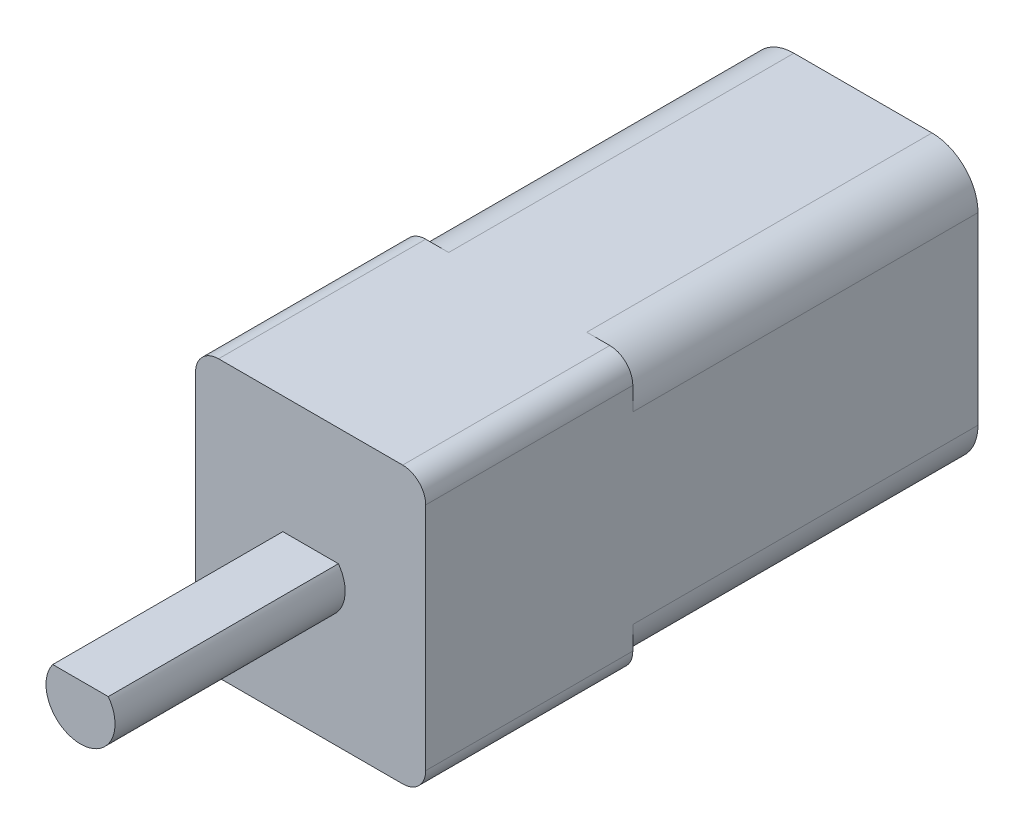
ISO-10303-21;
HEADER;
FILE_DESCRIPTION(('STEP AP214'),'2;1');
FILE_NAME('part.step','',(''),(''),'','','');
FILE_SCHEMA(('AUTOMOTIVE_DESIGN { 1 0 10303 214 1 1 1 1 }'));
ENDSEC;
DATA;
#1=APPLICATION_CONTEXT('core data for automotive mechanical design processes');
#2=APPLICATION_PROTOCOL_DEFINITION('international standard','automotive_design',2000,#1);
#3=PRODUCT_CONTEXT('',#1,'mechanical');
#4=PRODUCT('Part','Part','',(#3));
#5=PRODUCT_RELATED_PRODUCT_CATEGORY('part','',(#4));
#6=PRODUCT_DEFINITION_FORMATION('','',#4);
#7=PRODUCT_DEFINITION_CONTEXT('part definition',#1,'design');
#8=PRODUCT_DEFINITION('design','',#6,#7);
#9=PRODUCT_DEFINITION_SHAPE('','',#8);
#10=(LENGTH_UNIT() NAMED_UNIT(*) SI_UNIT(.MILLI.,.METRE.));
#11=(NAMED_UNIT(*) PLANE_ANGLE_UNIT() SI_UNIT($,.RADIAN.));
#12=(NAMED_UNIT(*) SI_UNIT($,.STERADIAN.) SOLID_ANGLE_UNIT());
#13=UNCERTAINTY_MEASURE_WITH_UNIT(LENGTH_MEASURE(1.E-05),#10,'distance_accuracy_value','');
#14=(GEOMETRIC_REPRESENTATION_CONTEXT(3) GLOBAL_UNCERTAINTY_ASSIGNED_CONTEXT((#13)) GLOBAL_UNIT_ASSIGNED_CONTEXT((#10,
#11,#12)) REPRESENTATION_CONTEXT('',''));
#15=CARTESIAN_POINT('',(0.,0.,0.));
#16=DIRECTION('',(0.,0.,1.));
#17=DIRECTION('',(1.,0.,0.));
#18=AXIS2_PLACEMENT_3D('',#15,#16,#17);
#19=CARTESIAN_POINT('',(1.,1.,24.));
#20=DIRECTION('',(0.,0.,-1.));
#21=DIRECTION('',(-1.,0.,0.));
#22=AXIS2_PLACEMENT_3D('',#19,#20,#21);
#23=PLANE('',#22);
#24=CARTESIAN_POINT('',(1.,1.,24.));
#25=DIRECTION('',(0.,0.,1.));
#26=DIRECTION('',(-1.,0.,0.));
#27=AXIS2_PLACEMENT_3D('',#24,#25,#26);
#28=CIRCLE('',#27,1.);
#29=CARTESIAN_POINT('',(0.,1.00000000000001,24.));
#30=VERTEX_POINT('',#29);
#31=CARTESIAN_POINT('',(1.00000000000001,0.,24.));
#32=VERTEX_POINT('',#31);
#33=EDGE_CURVE('E168',#30,#32,#28,.T.);
#34=ORIENTED_EDGE('',*,*,#33,.T.);
#35=DIRECTION('',(1.,0.,0.));
#36=VECTOR('',#35,1.);
#37=CARTESIAN_POINT('',(1.00000000000001,0.,24.));
#38=LINE('',#37,#36);
#39=CARTESIAN_POINT('',(8.99999999999999,0.,24.));
#40=VERTEX_POINT('',#39);
#41=EDGE_CURVE('E339',#32,#40,#38,.T.);
#42=ORIENTED_EDGE('',*,*,#41,.T.);
#43=CARTESIAN_POINT('',(9.,1.,24.));
#44=DIRECTION('',(0.,0.,1.));
#45=DIRECTION('',(-1.,0.,0.));
#46=AXIS2_PLACEMENT_3D('',#43,#44,#45);
#47=CIRCLE('',#46,1.);
#48=CARTESIAN_POINT('',(10.,1.00000000000001,24.));
#49=VERTEX_POINT('',#48);
#50=EDGE_CURVE('E312',#40,#49,#47,.T.);
#51=ORIENTED_EDGE('',*,*,#50,.T.);
#52=DIRECTION('',(0.,1.,0.));
#53=VECTOR('',#52,1.);
#54=CARTESIAN_POINT('',(10.,1.00000000000001,24.));
#55=LINE('',#54,#53);
#56=CARTESIAN_POINT('',(10.,11.,24.));
#57=VERTEX_POINT('',#56);
#58=EDGE_CURVE('E306',#49,#57,#55,.T.);
#59=ORIENTED_EDGE('',*,*,#58,.T.);
#60=CARTESIAN_POINT('',(9.,11.,24.));
#61=DIRECTION('',(0.,0.,1.));
#62=DIRECTION('',(1.,0.,0.));
#63=AXIS2_PLACEMENT_3D('',#60,#61,#62);
#64=CIRCLE('',#63,0.999999999999999);
#65=CARTESIAN_POINT('',(8.99999999999999,12.,24.));
#66=VERTEX_POINT('',#65);
#67=EDGE_CURVE('E297',#57,#66,#64,.T.);
#68=ORIENTED_EDGE('',*,*,#67,.T.);
#69=DIRECTION('',(-1.,0.,0.));
#70=VECTOR('',#69,1.);
#71=CARTESIAN_POINT('',(1.00000000000001,12.,24.));
#72=LINE('',#71,#70);
#73=CARTESIAN_POINT('',(1.00000000000001,12.,24.));
#74=VERTEX_POINT('',#73);
#75=EDGE_CURVE('E305',#66,#74,#72,.T.);
#76=ORIENTED_EDGE('',*,*,#75,.T.);
#77=CARTESIAN_POINT('',(1.,11.,24.));
#78=DIRECTION('',(0.,0.,1.));
#79=DIRECTION('',(-1.,0.,0.));
#80=AXIS2_PLACEMENT_3D('',#77,#78,#79);
#81=CIRCLE('',#80,1.);
#82=CARTESIAN_POINT('',(0.,11.,24.));
#83=VERTEX_POINT('',#82);
#84=EDGE_CURVE('E310',#74,#83,#81,.T.);
#85=ORIENTED_EDGE('',*,*,#84,.T.);
#86=DIRECTION('',(0.,-1.,0.));
#87=VECTOR('',#86,1.);
#88=CARTESIAN_POINT('',(0.,1.00000000000001,24.));
#89=LINE('',#88,#87);
#90=EDGE_CURVE('E174',#83,#30,#89,.T.);
#91=ORIENTED_EDGE('',*,*,#90,.T.);
#92=EDGE_LOOP('',(#34,#42,#51,#59,#68,#76,#85,#91));
#93=FACE_BOUND('',#92,.T.);
#94=CARTESIAN_POINT('',(5.,6.,24.));
#95=DIRECTION('',(0.,0.,1.));
#96=DIRECTION('',(1.,0.,0.));
#97=AXIS2_PLACEMENT_3D('',#94,#95,#96);
#98=CIRCLE('',#97,1.5);
#99=CARTESIAN_POINT('',(3.79333531330161,6.89104451845857,24.));
#100=VERTEX_POINT('',#99);
#101=CARTESIAN_POINT('',(6.20666468669839,6.89104451845857,24.));
#102=VERTEX_POINT('',#101);
#103=EDGE_CURVE('E56',#100,#102,#98,.T.);
#104=ORIENTED_EDGE('',*,*,#103,.F.);
#105=DIRECTION('',(1.,0.,0.));
#106=VECTOR('',#105,1.);
#107=CARTESIAN_POINT('',(0.,6.89104451845857,24.));
#108=LINE('',#107,#106);
#109=EDGE_CURVE('E387',#100,#102,#108,.T.);
#110=ORIENTED_EDGE('',*,*,#109,.T.);
#111=EDGE_LOOP('',(#104,#110));
#112=FACE_BOUND('',#111,.T.);
#113=ADVANCED_FACE('F41',(#93,#112),#23,.F.);
#114=CARTESIAN_POINT('',(2.,2.,15.));
#115=DIRECTION('',(0.,0.,-1.));
#116=DIRECTION('',(-1.,0.,0.));
#117=AXIS2_PLACEMENT_3D('',#114,#115,#116);
#118=CYLINDRICAL_SURFACE('',#117,2.);
#119=CARTESIAN_POINT('',(2.,2.,0.));
#120=DIRECTION('',(0.,0.,1.));
#121=DIRECTION('',(-1.,0.,0.));
#122=AXIS2_PLACEMENT_3D('',#119,#120,#121);
#123=CIRCLE('',#122,2.);
#124=CARTESIAN_POINT('',(0.,2.00000000000001,0.));
#125=VERTEX_POINT('',#124);
#126=CARTESIAN_POINT('',(2.00000000000001,0.,0.));
#127=VERTEX_POINT('',#126);
#128=EDGE_CURVE('E200',#125,#127,#123,.T.);
#129=ORIENTED_EDGE('',*,*,#128,.T.);
#130=DIRECTION('',(0.,0.,-1.));
#131=VECTOR('',#130,1.);
#132=CARTESIAN_POINT('',(2.00000000000001,0.,15.));
#133=LINE('',#132,#131);
#134=CARTESIAN_POINT('',(2.00000000000001,0.,15.));
#135=VERTEX_POINT('',#134);
#136=EDGE_CURVE('E11',#135,#127,#133,.T.);
#137=ORIENTED_EDGE('',*,*,#136,.F.);
#138=CARTESIAN_POINT('',(2.,2.,15.));
#139=DIRECTION('',(0.,0.,1.));
#140=DIRECTION('',(-1.,0.,0.));
#141=AXIS2_PLACEMENT_3D('',#138,#139,#140);
#142=CIRCLE('',#141,2.);
#143=CARTESIAN_POINT('',(0.,2.00000000000001,15.));
#144=VERTEX_POINT('',#143);
#145=EDGE_CURVE('E201',#144,#135,#142,.T.);
#146=ORIENTED_EDGE('',*,*,#145,.F.);
#147=DIRECTION('',(0.,0.,-1.));
#148=VECTOR('',#147,1.);
#149=CARTESIAN_POINT('',(0.,2.00000000000001,15.));
#150=LINE('',#149,#148);
#151=EDGE_CURVE('E65',#144,#125,#150,.T.);
#152=ORIENTED_EDGE('',*,*,#151,.T.);
#153=EDGE_LOOP('',(#129,#137,#146,#152));
#154=FACE_BOUND('',#153,.T.);
#155=ADVANCED_FACE('F43',(#154),#118,.T.);
#156=CARTESIAN_POINT('',(2.00000000000001,0.,15.));
#157=DIRECTION('',(0.,1.,0.));
#158=DIRECTION('',(0.,0.,1.));
#159=AXIS2_PLACEMENT_3D('',#156,#157,#158);
#160=PLANE('',#159);
#161=DIRECTION('',(1.,0.,0.));
#162=VECTOR('',#161,1.);
#163=CARTESIAN_POINT('',(2.00000000000001,0.,0.));
#164=LINE('',#163,#162);
#165=CARTESIAN_POINT('',(7.99999999999999,0.,0.));
#166=VERTEX_POINT('',#165);
#167=EDGE_CURVE('E212',#127,#166,#164,.T.);
#168=ORIENTED_EDGE('',*,*,#167,.T.);
#169=DIRECTION('',(0.,0.,-1.));
#170=VECTOR('',#169,1.);
#171=CARTESIAN_POINT('',(7.99999999999999,0.,15.));
#172=LINE('',#171,#170);
#173=CARTESIAN_POINT('',(7.99999999999999,0.,15.));
#174=VERTEX_POINT('',#173);
#175=EDGE_CURVE('E50',#174,#166,#172,.T.);
#176=ORIENTED_EDGE('',*,*,#175,.F.);
#177=DIRECTION('',(1.,0.,0.));
#178=VECTOR('',#177,1.);
#179=CARTESIAN_POINT('',(1.00000000000001,0.,15.));
#180=LINE('',#179,#178);
#181=CARTESIAN_POINT('',(8.99999999999999,0.,15.));
#182=VERTEX_POINT('',#181);
#183=EDGE_CURVE('E266',#174,#182,#180,.T.);
#184=ORIENTED_EDGE('',*,*,#183,.T.);
#185=DIRECTION('',(0.,0.,-1.));
#186=VECTOR('',#185,1.);
#187=CARTESIAN_POINT('',(8.99999999999999,0.,24.));
#188=LINE('',#187,#186);
#189=EDGE_CURVE('E192',#40,#182,#188,.T.);
#190=ORIENTED_EDGE('',*,*,#189,.F.);
#191=ORIENTED_EDGE('',*,*,#41,.F.);
#192=DIRECTION('',(0.,0.,-1.));
#193=VECTOR('',#192,1.);
#194=CARTESIAN_POINT('',(1.00000000000001,0.,24.));
#195=LINE('',#194,#193);
#196=CARTESIAN_POINT('',(1.00000000000001,0.,15.));
#197=VERTEX_POINT('',#196);
#198=EDGE_CURVE('E196',#32,#197,#195,.T.);
#199=ORIENTED_EDGE('',*,*,#198,.T.);
#200=EDGE_CURVE('E272',#197,#135,#180,.T.);
#201=ORIENTED_EDGE('',*,*,#200,.T.);
#202=ORIENTED_EDGE('',*,*,#136,.T.);
#203=EDGE_LOOP('',(#168,#176,#184,#190,#191,#199,#201,#202));
#204=FACE_BOUND('',#203,.T.);
#205=ADVANCED_FACE('F418',(#204),#160,.F.);
#206=CARTESIAN_POINT('',(8.,2.,15.));
#207=DIRECTION('',(0.,0.,-1.));
#208=DIRECTION('',(-1.,0.,0.));
#209=AXIS2_PLACEMENT_3D('',#206,#207,#208);
#210=CYLINDRICAL_SURFACE('',#209,2.);
#211=CARTESIAN_POINT('',(8.,2.,0.));
#212=DIRECTION('',(0.,0.,1.));
#213=DIRECTION('',(1.,0.,0.));
#214=AXIS2_PLACEMENT_3D('',#211,#212,#213);
#215=CIRCLE('',#214,2.);
#216=CARTESIAN_POINT('',(10.,2.,0.));
#217=VERTEX_POINT('',#216);
#218=EDGE_CURVE('E215',#166,#217,#215,.T.);
#219=ORIENTED_EDGE('',*,*,#218,.T.);
#220=DIRECTION('',(0.,0.,-1.));
#221=VECTOR('',#220,1.);
#222=CARTESIAN_POINT('',(10.,2.,15.));
#223=LINE('',#222,#221);
#224=CARTESIAN_POINT('',(10.,2.,15.));
#225=VERTEX_POINT('',#224);
#226=EDGE_CURVE('E241',#225,#217,#223,.T.);
#227=ORIENTED_EDGE('',*,*,#226,.F.);
#228=CARTESIAN_POINT('',(8.,2.,15.));
#229=DIRECTION('',(0.,0.,1.));
#230=DIRECTION('',(1.,0.,0.));
#231=AXIS2_PLACEMENT_3D('',#228,#229,#230);
#232=CIRCLE('',#231,2.);
#233=EDGE_CURVE('E143',#174,#225,#232,.T.);
#234=ORIENTED_EDGE('',*,*,#233,.F.);
#235=ORIENTED_EDGE('',*,*,#175,.T.);
#236=EDGE_LOOP('',(#219,#227,#234,#235));
#237=FACE_BOUND('',#236,.T.);
#238=ADVANCED_FACE('F249',(#237),#210,.T.);
#239=CARTESIAN_POINT('',(10.,2.00000000000001,15.));
#240=DIRECTION('',(-1.,0.,0.));
#241=DIRECTION('',(0.,0.,1.));
#242=AXIS2_PLACEMENT_3D('',#239,#240,#241);
#243=PLANE('',#242);
#244=DIRECTION('',(0.,1.,0.));
#245=VECTOR('',#244,1.);
#246=CARTESIAN_POINT('',(10.,2.00000000000001,0.));
#247=LINE('',#246,#245);
#248=CARTESIAN_POINT('',(10.,9.99999999999999,0.));
#249=VERTEX_POINT('',#248);
#250=EDGE_CURVE('E218',#217,#249,#247,.T.);
#251=ORIENTED_EDGE('',*,*,#250,.T.);
#252=DIRECTION('',(0.,0.,-1.));
#253=VECTOR('',#252,1.);
#254=CARTESIAN_POINT('',(10.,9.99999999999999,15.));
#255=LINE('',#254,#253);
#256=CARTESIAN_POINT('',(10.,9.99999999999999,15.));
#257=VERTEX_POINT('',#256);
#258=EDGE_CURVE('E130',#257,#249,#255,.T.);
#259=ORIENTED_EDGE('',*,*,#258,.F.);
#260=DIRECTION('',(0.,1.,0.));
#261=VECTOR('',#260,1.);
#262=CARTESIAN_POINT('',(10.,1.00000000000001,15.));
#263=LINE('',#262,#261);
#264=CARTESIAN_POINT('',(10.,11.,15.));
#265=VERTEX_POINT('',#264);
#266=EDGE_CURVE('E140',#257,#265,#263,.T.);
#267=ORIENTED_EDGE('',*,*,#266,.T.);
#268=DIRECTION('',(0.,0.,-1.));
#269=VECTOR('',#268,1.);
#270=CARTESIAN_POINT('',(10.,11.,24.));
#271=LINE('',#270,#269);
#272=EDGE_CURVE('E184',#57,#265,#271,.T.);
#273=ORIENTED_EDGE('',*,*,#272,.F.);
#274=ORIENTED_EDGE('',*,*,#58,.F.);
#275=DIRECTION('',(0.,0.,-1.));
#276=VECTOR('',#275,1.);
#277=CARTESIAN_POINT('',(10.,1.00000000000001,24.));
#278=LINE('',#277,#276);
#279=CARTESIAN_POINT('',(10.,1.00000000000001,15.));
#280=VERTEX_POINT('',#279);
#281=EDGE_CURVE('E188',#49,#280,#278,.T.);
#282=ORIENTED_EDGE('',*,*,#281,.T.);
#283=EDGE_CURVE('E261',#280,#225,#263,.T.);
#284=ORIENTED_EDGE('',*,*,#283,.T.);
#285=ORIENTED_EDGE('',*,*,#226,.T.);
#286=EDGE_LOOP('',(#251,#259,#267,#273,#274,#282,#284,#285));
#287=FACE_BOUND('',#286,.T.);
#288=ADVANCED_FACE('F258',(#287),#243,.F.);
#289=CARTESIAN_POINT('',(8.,10.,15.));
#290=DIRECTION('',(0.,0.,-1.));
#291=DIRECTION('',(-1.,0.,0.));
#292=AXIS2_PLACEMENT_3D('',#289,#290,#291);
#293=CYLINDRICAL_SURFACE('',#292,2.);
#294=CARTESIAN_POINT('',(8.,10.,0.));
#295=DIRECTION('',(0.,0.,1.));
#296=DIRECTION('',(1.,0.,0.));
#297=AXIS2_PLACEMENT_3D('',#294,#295,#296);
#298=CIRCLE('',#297,2.);
#299=CARTESIAN_POINT('',(7.99999999999999,12.,0.));
#300=VERTEX_POINT('',#299);
#301=EDGE_CURVE('E125',#249,#300,#298,.T.);
#302=ORIENTED_EDGE('',*,*,#301,.T.);
#303=DIRECTION('',(0.,0.,-1.));
#304=VECTOR('',#303,1.);
#305=CARTESIAN_POINT('',(7.99999999999999,12.,15.));
#306=LINE('',#305,#304);
#307=CARTESIAN_POINT('',(7.99999999999999,12.,15.));
#308=VERTEX_POINT('',#307);
#309=EDGE_CURVE('E118',#308,#300,#306,.T.);
#310=ORIENTED_EDGE('',*,*,#309,.F.);
#311=CARTESIAN_POINT('',(8.,10.,15.));
#312=DIRECTION('',(0.,0.,1.));
#313=DIRECTION('',(1.,0.,0.));
#314=AXIS2_PLACEMENT_3D('',#311,#312,#313);
#315=CIRCLE('',#314,2.);
#316=EDGE_CURVE('E122',#257,#308,#315,.T.);
#317=ORIENTED_EDGE('',*,*,#316,.F.);
#318=ORIENTED_EDGE('',*,*,#258,.T.);
#319=EDGE_LOOP('',(#302,#310,#317,#318));
#320=FACE_BOUND('',#319,.T.);
#321=ADVANCED_FACE('F120',(#320),#293,.T.);
#322=CARTESIAN_POINT('',(2.00000000000001,12.,15.));
#323=DIRECTION('',(0.,-1.,0.));
#324=DIRECTION('',(0.,0.,-1.));
#325=AXIS2_PLACEMENT_3D('',#322,#323,#324);
#326=PLANE('',#325);
#327=DIRECTION('',(-1.,0.,0.));
#328=VECTOR('',#327,1.);
#329=CARTESIAN_POINT('',(2.00000000000001,12.,0.));
#330=LINE('',#329,#328);
#331=CARTESIAN_POINT('',(2.00000000000001,12.,0.));
#332=VERTEX_POINT('',#331);
#333=EDGE_CURVE('E223',#300,#332,#330,.T.);
#334=ORIENTED_EDGE('',*,*,#333,.T.);
#335=DIRECTION('',(0.,0.,-1.));
#336=VECTOR('',#335,1.);
#337=CARTESIAN_POINT('',(2.00000000000001,12.,15.));
#338=LINE('',#337,#336);
#339=CARTESIAN_POINT('',(2.00000000000001,12.,15.));
#340=VERTEX_POINT('',#339);
#341=EDGE_CURVE('E131',#340,#332,#338,.T.);
#342=ORIENTED_EDGE('',*,*,#341,.F.);
#343=DIRECTION('',(-1.,0.,0.));
#344=VECTOR('',#343,1.);
#345=CARTESIAN_POINT('',(1.00000000000001,12.,15.));
#346=LINE('',#345,#344);
#347=CARTESIAN_POINT('',(1.00000000000001,12.,15.));
#348=VERTEX_POINT('',#347);
#349=EDGE_CURVE('E152',#340,#348,#346,.T.);
#350=ORIENTED_EDGE('',*,*,#349,.T.);
#351=DIRECTION('',(0.,0.,-1.));
#352=VECTOR('',#351,1.);
#353=CARTESIAN_POINT('',(1.00000000000001,12.,24.));
#354=LINE('',#353,#352);
#355=EDGE_CURVE('E178',#74,#348,#354,.T.);
#356=ORIENTED_EDGE('',*,*,#355,.F.);
#357=ORIENTED_EDGE('',*,*,#75,.F.);
#358=DIRECTION('',(0.,0.,-1.));
#359=VECTOR('',#358,1.);
#360=CARTESIAN_POINT('',(8.99999999999999,12.,24.));
#361=LINE('',#360,#359);
#362=CARTESIAN_POINT('',(8.99999999999999,12.,15.));
#363=VERTEX_POINT('',#362);
#364=EDGE_CURVE('E149',#66,#363,#361,.T.);
#365=ORIENTED_EDGE('',*,*,#364,.T.);
#366=EDGE_CURVE('E138',#363,#308,#346,.T.);
#367=ORIENTED_EDGE('',*,*,#366,.T.);
#368=ORIENTED_EDGE('',*,*,#309,.T.);
#369=EDGE_LOOP('',(#334,#342,#350,#356,#357,#365,#367,#368));
#370=FACE_BOUND('',#369,.T.);
#371=ADVANCED_FACE('F146',(#370),#326,.F.);
#372=CARTESIAN_POINT('',(2.,10.,15.));
#373=DIRECTION('',(0.,0.,-1.));
#374=DIRECTION('',(-1.,0.,0.));
#375=AXIS2_PLACEMENT_3D('',#372,#373,#374);
#376=CYLINDRICAL_SURFACE('',#375,2.);
#377=CARTESIAN_POINT('',(2.,10.,0.));
#378=DIRECTION('',(0.,0.,1.));
#379=DIRECTION('',(-1.,0.,0.));
#380=AXIS2_PLACEMENT_3D('',#377,#378,#379);
#381=CIRCLE('',#380,2.);
#382=CARTESIAN_POINT('',(0.,9.99999999999999,0.));
#383=VERTEX_POINT('',#382);
#384=EDGE_CURVE('E226',#332,#383,#381,.T.);
#385=ORIENTED_EDGE('',*,*,#384,.T.);
#386=DIRECTION('',(0.,0.,-1.));
#387=VECTOR('',#386,1.);
#388=CARTESIAN_POINT('',(0.,9.99999999999999,15.));
#389=LINE('',#388,#387);
#390=CARTESIAN_POINT('',(0.,10.,15.));
#391=VERTEX_POINT('',#390);
#392=EDGE_CURVE('E233',#391,#383,#389,.T.);
#393=ORIENTED_EDGE('',*,*,#392,.F.);
#394=CARTESIAN_POINT('',(2.,10.,15.));
#395=DIRECTION('',(0.,0.,1.));
#396=DIRECTION('',(-1.,0.,0.));
#397=AXIS2_PLACEMENT_3D('',#394,#395,#396);
#398=CIRCLE('',#397,2.);
#399=EDGE_CURVE('E142',#340,#391,#398,.T.);
#400=ORIENTED_EDGE('',*,*,#399,.F.);
#401=ORIENTED_EDGE('',*,*,#341,.T.);
#402=EDGE_LOOP('',(#385,#393,#400,#401));
#403=FACE_BOUND('',#402,.T.);
#404=ADVANCED_FACE('F440',(#403),#376,.T.);
#405=CARTESIAN_POINT('',(0.,2.00000000000001,15.));
#406=DIRECTION('',(1.,0.,0.));
#407=DIRECTION('',(0.,0.,-1.));
#408=AXIS2_PLACEMENT_3D('',#405,#406,#407);
#409=PLANE('',#408);
#410=DIRECTION('',(0.,-1.,0.));
#411=VECTOR('',#410,1.);
#412=CARTESIAN_POINT('',(0.,2.00000000000001,0.));
#413=LINE('',#412,#411);
#414=EDGE_CURVE('E97',#383,#125,#413,.T.);
#415=ORIENTED_EDGE('',*,*,#414,.T.);
#416=ORIENTED_EDGE('',*,*,#151,.F.);
#417=DIRECTION('',(0.,-1.,0.));
#418=VECTOR('',#417,1.);
#419=CARTESIAN_POINT('',(0.,1.00000000000001,15.));
#420=LINE('',#419,#418);
#421=CARTESIAN_POINT('',(0.,1.00000000000001,15.));
#422=VERTEX_POINT('',#421);
#423=EDGE_CURVE('E157',#144,#422,#420,.T.);
#424=ORIENTED_EDGE('',*,*,#423,.T.);
#425=DIRECTION('',(0.,0.,-1.));
#426=VECTOR('',#425,1.);
#427=CARTESIAN_POINT('',(0.,1.00000000000001,24.));
#428=LINE('',#427,#426);
#429=EDGE_CURVE('E169',#30,#422,#428,.T.);
#430=ORIENTED_EDGE('',*,*,#429,.F.);
#431=ORIENTED_EDGE('',*,*,#90,.F.);
#432=DIRECTION('',(0.,0.,-1.));
#433=VECTOR('',#432,1.);
#434=CARTESIAN_POINT('',(0.,11.,24.));
#435=LINE('',#434,#433);
#436=CARTESIAN_POINT('',(0.,11.,15.));
#437=VERTEX_POINT('',#436);
#438=EDGE_CURVE('E173',#83,#437,#435,.T.);
#439=ORIENTED_EDGE('',*,*,#438,.T.);
#440=EDGE_CURVE('E164',#437,#391,#420,.T.);
#441=ORIENTED_EDGE('',*,*,#440,.T.);
#442=ORIENTED_EDGE('',*,*,#392,.T.);
#443=EDGE_LOOP('',(#415,#416,#424,#430,#431,#439,#441,#442));
#444=FACE_BOUND('',#443,.T.);
#445=ADVANCED_FACE('F332',(#444),#409,.F.);
#446=CARTESIAN_POINT('',(2.,2.,0.));
#447=DIRECTION('',(0.,0.,-1.));
#448=DIRECTION('',(-1.,0.,0.));
#449=AXIS2_PLACEMENT_3D('',#446,#447,#448);
#450=PLANE('',#449);
#451=ORIENTED_EDGE('',*,*,#128,.F.);
#452=ORIENTED_EDGE('',*,*,#414,.F.);
#453=ORIENTED_EDGE('',*,*,#384,.F.);
#454=ORIENTED_EDGE('',*,*,#333,.F.);
#455=ORIENTED_EDGE('',*,*,#301,.F.);
#456=ORIENTED_EDGE('',*,*,#250,.F.);
#457=ORIENTED_EDGE('',*,*,#218,.F.);
#458=ORIENTED_EDGE('',*,*,#167,.F.);
#459=EDGE_LOOP('',(#451,#452,#453,#454,#455,#456,#457,#458));
#460=FACE_BOUND('',#459,.T.);
#461=ADVANCED_FACE('F256',(#460),#450,.T.);
#462=CARTESIAN_POINT('',(1.,1.,15.));
#463=DIRECTION('',(0.,0.,-1.));
#464=DIRECTION('',(-1.,0.,0.));
#465=AXIS2_PLACEMENT_3D('',#462,#463,#464);
#466=PLANE('',#465);
#467=ORIENTED_EDGE('',*,*,#423,.F.);
#468=ORIENTED_EDGE('',*,*,#145,.T.);
#469=ORIENTED_EDGE('',*,*,#200,.F.);
#470=CARTESIAN_POINT('',(1.,1.,15.));
#471=DIRECTION('',(0.,0.,1.));
#472=DIRECTION('',(-1.,0.,0.));
#473=AXIS2_PLACEMENT_3D('',#470,#471,#472);
#474=CIRCLE('',#473,1.);
#475=EDGE_CURVE('E273',#422,#197,#474,.T.);
#476=ORIENTED_EDGE('',*,*,#475,.F.);
#477=EDGE_LOOP('',(#467,#468,#469,#476));
#478=FACE_BOUND('',#477,.T.);
#479=ADVANCED_FACE('F426',(#478),#466,.T.);
#480=ORIENTED_EDGE('',*,*,#183,.F.);
#481=ORIENTED_EDGE('',*,*,#233,.T.);
#482=ORIENTED_EDGE('',*,*,#283,.F.);
#483=CARTESIAN_POINT('',(9.,1.,15.));
#484=DIRECTION('',(0.,0.,1.));
#485=DIRECTION('',(-1.,0.,0.));
#486=AXIS2_PLACEMENT_3D('',#483,#484,#485);
#487=CIRCLE('',#486,1.);
#488=EDGE_CURVE('E269',#182,#280,#487,.T.);
#489=ORIENTED_EDGE('',*,*,#488,.F.);
#490=EDGE_LOOP('',(#480,#481,#482,#489));
#491=FACE_BOUND('',#490,.T.);
#492=ADVANCED_FACE('F263',(#491),#466,.T.);
#493=ORIENTED_EDGE('',*,*,#266,.F.);
#494=ORIENTED_EDGE('',*,*,#316,.T.);
#495=ORIENTED_EDGE('',*,*,#366,.F.);
#496=CARTESIAN_POINT('',(9.,11.,15.));
#497=DIRECTION('',(0.,0.,1.));
#498=DIRECTION('',(1.,0.,0.));
#499=AXIS2_PLACEMENT_3D('',#496,#497,#498);
#500=CIRCLE('',#499,0.999999999999999);
#501=EDGE_CURVE('E160',#265,#363,#500,.T.);
#502=ORIENTED_EDGE('',*,*,#501,.F.);
#503=EDGE_LOOP('',(#493,#494,#495,#502));
#504=FACE_BOUND('',#503,.T.);
#505=ADVANCED_FACE('F135',(#504),#466,.T.);
#506=CARTESIAN_POINT('',(1.,1.,24.));
#507=DIRECTION('',(0.,0.,-1.));
#508=DIRECTION('',(-1.,0.,0.));
#509=AXIS2_PLACEMENT_3D('',#506,#507,#508);
#510=CYLINDRICAL_SURFACE('',#509,1.);
#511=ORIENTED_EDGE('',*,*,#475,.T.);
#512=ORIENTED_EDGE('',*,*,#198,.F.);
#513=ORIENTED_EDGE('',*,*,#33,.F.);
#514=ORIENTED_EDGE('',*,*,#429,.T.);
#515=EDGE_LOOP('',(#511,#512,#513,#514));
#516=FACE_BOUND('',#515,.T.);
#517=ADVANCED_FACE('F337',(#516),#510,.T.);
#518=CARTESIAN_POINT('',(9.,1.,24.));
#519=DIRECTION('',(0.,0.,-1.));
#520=DIRECTION('',(-1.,0.,0.));
#521=AXIS2_PLACEMENT_3D('',#518,#519,#520);
#522=CYLINDRICAL_SURFACE('',#521,1.);
#523=ORIENTED_EDGE('',*,*,#488,.T.);
#524=ORIENTED_EDGE('',*,*,#281,.F.);
#525=ORIENTED_EDGE('',*,*,#50,.F.);
#526=ORIENTED_EDGE('',*,*,#189,.T.);
#527=EDGE_LOOP('',(#523,#524,#525,#526));
#528=FACE_BOUND('',#527,.T.);
#529=ADVANCED_FACE('F353',(#528),#522,.T.);
#530=CARTESIAN_POINT('',(9.,11.,24.));
#531=DIRECTION('',(0.,0.,-1.));
#532=DIRECTION('',(-1.,0.,0.));
#533=AXIS2_PLACEMENT_3D('',#530,#531,#532);
#534=CYLINDRICAL_SURFACE('',#533,0.999999999999999);
#535=ORIENTED_EDGE('',*,*,#501,.T.);
#536=ORIENTED_EDGE('',*,*,#364,.F.);
#537=ORIENTED_EDGE('',*,*,#67,.F.);
#538=ORIENTED_EDGE('',*,*,#272,.T.);
#539=EDGE_LOOP('',(#535,#536,#537,#538));
#540=FACE_BOUND('',#539,.T.);
#541=ADVANCED_FACE('F295',(#540),#534,.T.);
#542=CARTESIAN_POINT('',(1.,11.,24.));
#543=DIRECTION('',(0.,0.,-1.));
#544=DIRECTION('',(-1.,0.,0.));
#545=AXIS2_PLACEMENT_3D('',#542,#543,#544);
#546=CYLINDRICAL_SURFACE('',#545,1.);
#547=CARTESIAN_POINT('',(1.,11.,15.));
#548=DIRECTION('',(0.,0.,1.));
#549=DIRECTION('',(-1.,0.,0.));
#550=AXIS2_PLACEMENT_3D('',#547,#548,#549);
#551=CIRCLE('',#550,1.);
#552=EDGE_CURVE('E151',#348,#437,#551,.T.);
#553=ORIENTED_EDGE('',*,*,#552,.T.);
#554=ORIENTED_EDGE('',*,*,#438,.F.);
#555=ORIENTED_EDGE('',*,*,#84,.F.);
#556=ORIENTED_EDGE('',*,*,#355,.T.);
#557=EDGE_LOOP('',(#553,#554,#555,#556));
#558=FACE_BOUND('',#557,.T.);
#559=ADVANCED_FACE('F424',(#558),#546,.T.);
#560=ORIENTED_EDGE('',*,*,#349,.F.);
#561=ORIENTED_EDGE('',*,*,#399,.T.);
#562=ORIENTED_EDGE('',*,*,#440,.F.);
#563=ORIENTED_EDGE('',*,*,#552,.F.);
#564=EDGE_LOOP('',(#560,#561,#562,#563));
#565=FACE_BOUND('',#564,.T.);
#566=ADVANCED_FACE('F421',(#565),#466,.T.);
#567=CARTESIAN_POINT('',(0.,6.89104451845857,34.));
#568=DIRECTION('',(0.,1.,0.));
#569=DIRECTION('',(0.,0.,1.));
#570=AXIS2_PLACEMENT_3D('',#567,#568,#569);
#571=PLANE('',#570);
#572=ORIENTED_EDGE('',*,*,#109,.F.);
#573=DIRECTION('',(0.,0.,-1.));
#574=VECTOR('',#573,1.);
#575=CARTESIAN_POINT('',(3.79333531330161,6.89104451845857,34.));
#576=LINE('',#575,#574);
#577=CARTESIAN_POINT('',(3.79333531330161,6.89104451845857,34.));
#578=VERTEX_POINT('',#577);
#579=EDGE_CURVE('E279',#578,#100,#576,.T.);
#580=ORIENTED_EDGE('',*,*,#579,.F.);
#581=DIRECTION('',(1.,0.,0.));
#582=VECTOR('',#581,1.);
#583=CARTESIAN_POINT('',(0.,6.89104451845857,34.));
#584=LINE('',#583,#582);
#585=CARTESIAN_POINT('',(6.20666468669839,6.89104451845857,34.));
#586=VERTEX_POINT('',#585);
#587=EDGE_CURVE('E393',#578,#586,#584,.T.);
#588=ORIENTED_EDGE('',*,*,#587,.T.);
#589=DIRECTION('',(0.,0.,-1.));
#590=VECTOR('',#589,1.);
#591=CARTESIAN_POINT('',(6.20666468669839,6.89104451845857,34.));
#592=LINE('',#591,#590);
#593=EDGE_CURVE('E391',#586,#102,#592,.T.);
#594=ORIENTED_EDGE('',*,*,#593,.T.);
#595=EDGE_LOOP('',(#572,#580,#588,#594));
#596=FACE_BOUND('',#595,.T.);
#597=ADVANCED_FACE('F392',(#596),#571,.T.);
#598=CARTESIAN_POINT('',(5.,6.,34.));
#599=DIRECTION('',(0.,0.,-1.));
#600=DIRECTION('',(-1.,0.,0.));
#601=AXIS2_PLACEMENT_3D('',#598,#599,#600);
#602=CYLINDRICAL_SURFACE('',#601,1.5);
#603=ORIENTED_EDGE('',*,*,#103,.T.);
#604=ORIENTED_EDGE('',*,*,#593,.F.);
#605=CARTESIAN_POINT('',(5.,6.,34.));
#606=DIRECTION('',(0.,0.,1.));
#607=DIRECTION('',(1.,0.,0.));
#608=AXIS2_PLACEMENT_3D('',#605,#606,#607);
#609=CIRCLE('',#608,1.5);
#610=EDGE_CURVE('E380',#578,#586,#609,.T.);
#611=ORIENTED_EDGE('',*,*,#610,.F.);
#612=ORIENTED_EDGE('',*,*,#579,.T.);
#613=EDGE_LOOP('',(#603,#604,#611,#612));
#614=FACE_BOUND('',#613,.T.);
#615=ADVANCED_FACE('F396',(#614),#602,.T.);
#616=CARTESIAN_POINT('',(0.,0.,34.));
#617=DIRECTION('',(0.,0.,1.));
#618=DIRECTION('',(1.,0.,0.));
#619=AXIS2_PLACEMENT_3D('',#616,#617,#618);
#620=PLANE('',#619);
#621=ORIENTED_EDGE('',*,*,#587,.F.);
#622=ORIENTED_EDGE('',*,*,#610,.T.);
#623=EDGE_LOOP('',(#621,#622));
#624=FACE_BOUND('',#623,.T.);
#625=ADVANCED_FACE('F404',(#624),#620,.T.);
#626=CLOSED_SHELL('',(#113,#155,#205,#238,#288,#321,#371,#404,#445,#461,#479,#492,#505,#517,
#529,#541,#559,#566,#597,#615,#625));
#627=MANIFOLD_SOLID_BREP('B2',#626);
#628=ADVANCED_BREP_SHAPE_REPRESENTATION('',(#18,#627),#14);
#629=SHAPE_DEFINITION_REPRESENTATION(#9,#628);
ENDSEC;
END-ISO-10303-21;
